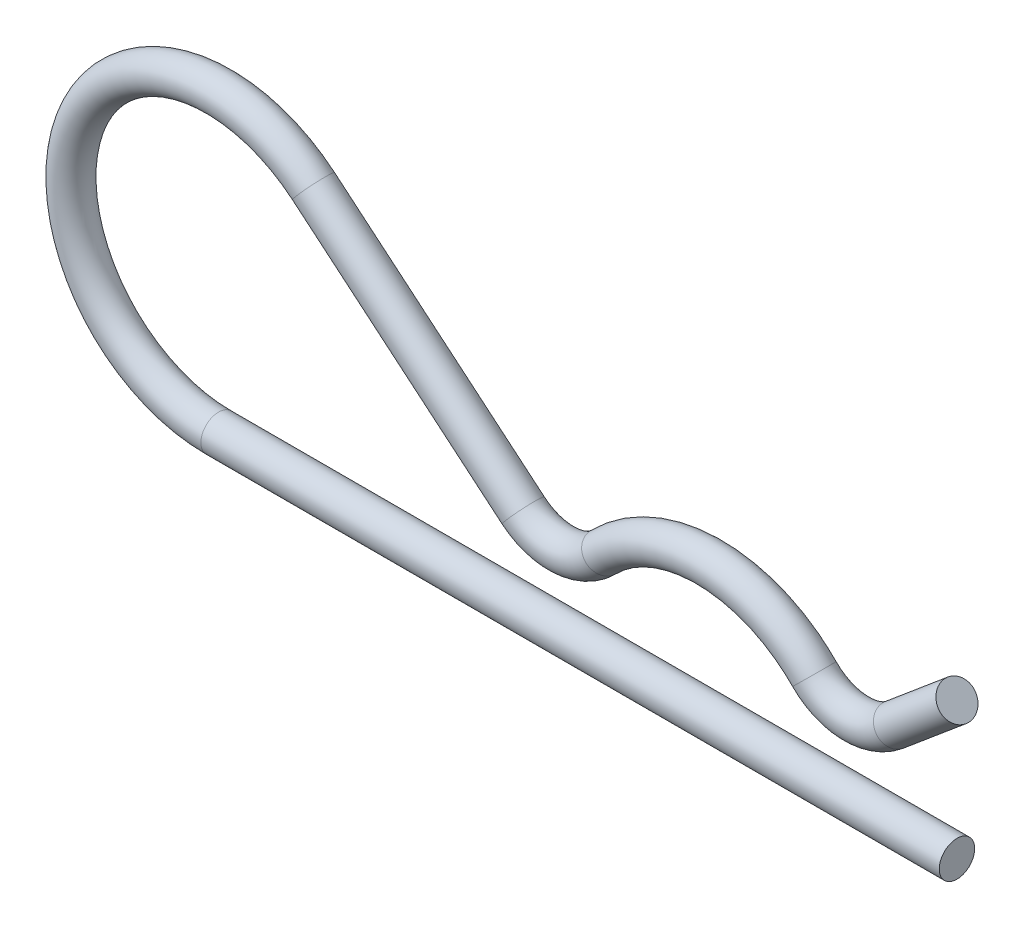
ISO-10303-21;
HEADER;
FILE_DESCRIPTION(('STEP AP214'),'2;1');
FILE_NAME('part.step','',(''),(''),'','','');
FILE_SCHEMA(('AUTOMOTIVE_DESIGN { 1 0 10303 214 1 1 1 1 }'));
ENDSEC;
DATA;
#1=APPLICATION_CONTEXT('core data for automotive mechanical design processes');
#2=APPLICATION_PROTOCOL_DEFINITION('international standard','automotive_design',2000,#1);
#3=PRODUCT_CONTEXT('',#1,'mechanical');
#4=PRODUCT('Part','Part','',(#3));
#5=PRODUCT_RELATED_PRODUCT_CATEGORY('part','',(#4));
#6=PRODUCT_DEFINITION_FORMATION('','',#4);
#7=PRODUCT_DEFINITION_CONTEXT('part definition',#1,'design');
#8=PRODUCT_DEFINITION('design','',#6,#7);
#9=PRODUCT_DEFINITION_SHAPE('','',#8);
#10=(LENGTH_UNIT() NAMED_UNIT(*) SI_UNIT(.MILLI.,.METRE.));
#11=(NAMED_UNIT(*) PLANE_ANGLE_UNIT() SI_UNIT($,.RADIAN.));
#12=(NAMED_UNIT(*) SI_UNIT($,.STERADIAN.) SOLID_ANGLE_UNIT());
#13=UNCERTAINTY_MEASURE_WITH_UNIT(LENGTH_MEASURE(1.E-05),#10,'distance_accuracy_value','');
#14=(GEOMETRIC_REPRESENTATION_CONTEXT(3) GLOBAL_UNCERTAINTY_ASSIGNED_CONTEXT((#13)) GLOBAL_UNIT_ASSIGNED_CONTEXT((#10,
#11,#12)) REPRESENTATION_CONTEXT('',''));
#15=CARTESIAN_POINT('',(0.,0.,0.));
#16=DIRECTION('',(0.,0.,1.));
#17=DIRECTION('',(1.,0.,0.));
#18=AXIS2_PLACEMENT_3D('',#15,#16,#17);
#19=CARTESIAN_POINT('',(0.,0.,0.));
#20=DIRECTION('',(1.,0.,0.));
#21=DIRECTION('',(0.,0.,-1.));
#22=AXIS2_PLACEMENT_3D('',#19,#20,#21);
#23=PLANE('',#22);
#24=CARTESIAN_POINT('',(0.,0.,0.));
#25=DIRECTION('',(1.,0.,0.));
#26=DIRECTION('',(0.,0.,-1.));
#27=AXIS2_PLACEMENT_3D('',#24,#25,#26);
#28=CIRCLE('',#27,1.524);
#29=CARTESIAN_POINT('',(0.,0.,-1.524));
#30=VERTEX_POINT('',#29);
#31=EDGE_CURVE('E72',#30,#30,#28,.T.);
#32=ORIENTED_EDGE('',*,*,#31,.T.);
#33=EDGE_LOOP('',(#32));
#34=FACE_BOUND('',#33,.T.);
#35=ADVANCED_FACE('F37',(#34),#23,.T.);
#36=CARTESIAN_POINT('',(0.,11.8019054563597,0.));
#37=DIRECTION('',(-0.766044443118981,-0.642787609686536,0.));
#38=DIRECTION('',(0.,0.,-1.));
#39=AXIS2_PLACEMENT_3D('',#36,#37,#38);
#40=PLANE('',#39);
#41=CARTESIAN_POINT('',(0.,11.8019054563597,0.));
#42=DIRECTION('',(-0.766044443118981,-0.642787609686536,0.));
#43=DIRECTION('',(0.,0.,-1.));
#44=AXIS2_PLACEMENT_3D('',#41,#42,#43);
#45=CIRCLE('',#44,1.524);
#46=CARTESIAN_POINT('',(0.,11.8019054563597,-1.524));
#47=VERTEX_POINT('',#46);
#48=EDGE_CURVE('E10',#47,#47,#45,.T.);
#49=ORIENTED_EDGE('',*,*,#48,.F.);
#50=EDGE_LOOP('',(#49));
#51=FACE_BOUND('',#50,.T.);
#52=ADVANCED_FACE('F81',(#51),#40,.F.);
#53=CARTESIAN_POINT('',(0.,0.,0.));
#54=DIRECTION('',(-1.,0.,0.));
#55=DIRECTION('',(0.,0.,1.));
#56=AXIS2_PLACEMENT_3D('',#53,#54,#55);
#57=CYLINDRICAL_SURFACE('',#56,1.524);
#58=CARTESIAN_POINT('',(-63.5,0.,0.));
#59=DIRECTION('',(1.,0.,0.));
#60=DIRECTION('',(0.,0.,-1.));
#61=AXIS2_PLACEMENT_3D('',#58,#59,#60);
#62=CIRCLE('',#61,1.524);
#63=CARTESIAN_POINT('',(-63.5,-1.524,0.));
#64=VERTEX_POINT('',#63);
#65=EDGE_CURVE('E68',#64,#64,#62,.T.);
#66=ORIENTED_EDGE('',*,*,#65,.T.);
#67=EDGE_LOOP('',(#66));
#68=FACE_BOUND('',#67,.T.);
#69=ORIENTED_EDGE('',*,*,#31,.F.);
#70=EDGE_LOOP('',(#69));
#71=FACE_BOUND('',#70,.T.);
#72=ADVANCED_FACE('F78',(#68,#71),#57,.T.);
#73=CARTESIAN_POINT('',(-63.5,12.7,0.));
#74=DIRECTION('',(0.,0.,-1.));
#75=DIRECTION('',(-1.,0.,0.));
#76=AXIS2_PLACEMENT_3D('',#73,#74,#75);
#77=TOROIDAL_SURFACE('',#76,12.7,1.524);
#78=CARTESIAN_POINT('',(-55.336597356981,22.4287644276111,0.));
#79=DIRECTION('',(-0.766044443118982,0.642787609686535,0.));
#80=DIRECTION('',(0.,0.,-1.));
#81=AXIS2_PLACEMENT_3D('',#78,#79,#80);
#82=CIRCLE('',#81,1.524);
#83=CARTESIAN_POINT('',(-54.3569890398187,23.5962161589244,0.));
#84=VERTEX_POINT('',#83);
#85=EDGE_CURVE('E64',#84,#84,#82,.T.);
#86=CARTESIAN_POINT('',(-63.5,12.7,0.));
#87=DIRECTION('',(0.,0.,-1.));
#88=DIRECTION('',(-1.,0.,0.));
#89=AXIS2_PLACEMENT_3D('',#86,#87,#88);
#90=CIRCLE('',#89,14.224);
#91=EDGE_CURVE('',#64,#84,#90,.T.);
#92=ORIENTED_EDGE('',*,*,#65,.F.);
#93=ORIENTED_EDGE('',*,*,#85,.T.);
#94=ORIENTED_EDGE('',*,*,#91,.T.);
#95=ORIENTED_EDGE('',*,*,#91,.F.);
#96=EDGE_LOOP('',(#92,#94,#93,#95));
#97=FACE_BOUND('',#96,.T.);
#98=ADVANCED_FACE('F80',(#97),#77,.T.);
#99=CARTESIAN_POINT('',(-55.336597356981,22.4287644276111,0.));
#100=DIRECTION('',(0.766044443118982,-0.642787609686535,0.));
#101=DIRECTION('',(0.642787609686535,0.766044443118982,0.));
#102=AXIS2_PLACEMENT_3D('',#99,#100,#101);
#103=CYLINDRICAL_SURFACE('',#102,1.524);
#104=CARTESIAN_POINT('',(-37.3013610572076,7.29540430027629,0.));
#105=DIRECTION('',(-0.766044443118982,0.642787609686535,0.));
#106=DIRECTION('',(0.,0.,-1.));
#107=AXIS2_PLACEMENT_3D('',#104,#105,#106);
#108=CIRCLE('',#107,1.524);
#109=CARTESIAN_POINT('',(-38.2809693743699,6.12795256896296,0.));
#110=VERTEX_POINT('',#109);
#111=EDGE_CURVE('E60',#110,#110,#108,.T.);
#112=ORIENTED_EDGE('',*,*,#111,.T.);
#113=EDGE_LOOP('',(#112));
#114=FACE_BOUND('',#113,.T.);
#115=ORIENTED_EDGE('',*,*,#85,.F.);
#116=EDGE_LOOP('',(#115));
#117=FACE_BOUND('',#116,.T.);
#118=ADVANCED_FACE('F88',(#114,#117),#103,.T.);
#119=CARTESIAN_POINT('',(-34.036,11.1869100713207,0.));
#120=DIRECTION('',(0.,0.,1.));
#121=DIRECTION('',(1.,0.,0.));
#122=AXIS2_PLACEMENT_3D('',#119,#120,#121);
#123=TOROIDAL_SURFACE('',#122,5.08,1.524);
#124=CARTESIAN_POINT('',(-30.4074285714286,7.63165067322398,0.));
#125=DIRECTION('',(-0.699854212223765,-0.714285714285714,0.));
#126=DIRECTION('',(0.,0.,-1.));
#127=AXIS2_PLACEMENT_3D('',#124,#125,#126);
#128=CIRCLE('',#127,1.524);
#129=CARTESIAN_POINT('',(-29.3188571428571,6.56507285379496,0.));
#130=VERTEX_POINT('',#129);
#131=EDGE_CURVE('E54',#130,#130,#128,.T.);
#132=CARTESIAN_POINT('',(-34.036,11.1869100713207,0.));
#133=DIRECTION('',(0.,0.,1.));
#134=DIRECTION('',(1.,0.,0.));
#135=AXIS2_PLACEMENT_3D('',#132,#133,#134);
#136=CIRCLE('',#135,6.604);
#137=EDGE_CURVE('',#110,#130,#136,.T.);
#138=ORIENTED_EDGE('',*,*,#111,.F.);
#139=ORIENTED_EDGE('',*,*,#131,.T.);
#140=ORIENTED_EDGE('',*,*,#137,.T.);
#141=ORIENTED_EDGE('',*,*,#137,.F.);
#142=EDGE_LOOP('',(#138,#140,#139,#141));
#143=FACE_BOUND('',#142,.T.);
#144=ADVANCED_FACE('F105',(#143),#123,.T.);
#145=CARTESIAN_POINT('',(-21.336,-1.25649782201783,0.));
#146=DIRECTION('',(0.,0.,-1.));
#147=DIRECTION('',(-1.,0.,0.));
#148=AXIS2_PLACEMENT_3D('',#145,#146,#147);
#149=TOROIDAL_SURFACE('',#148,12.7,1.524);
#150=CARTESIAN_POINT('',(-12.2645714285714,7.63165067322398,0.));
#151=DIRECTION('',(-0.699854212223765,0.714285714285714,0.));
#152=DIRECTION('',(0.,0.,-1.));
#153=AXIS2_PLACEMENT_3D('',#150,#151,#152);
#154=CIRCLE('',#153,1.524);
#155=CARTESIAN_POINT('',(-13.3531428571429,6.56507285379497,0.));
#156=VERTEX_POINT('',#155);
#157=EDGE_CURVE('E49',#156,#156,#154,.T.);
#158=ORIENTED_EDGE('',*,*,#157,.T.);
#159=EDGE_LOOP('',(#158));
#160=FACE_BOUND('',#159,.T.);
#161=ORIENTED_EDGE('',*,*,#131,.F.);
#162=EDGE_LOOP('',(#161));
#163=FACE_BOUND('',#162,.T.);
#164=ADVANCED_FACE('F99',(#160,#163),#149,.T.);
#165=CARTESIAN_POINT('',(-8.636,11.1869100713207,0.));
#166=DIRECTION('',(0.,0.,1.));
#167=DIRECTION('',(1.,0.,0.));
#168=AXIS2_PLACEMENT_3D('',#165,#166,#167);
#169=TOROIDAL_SURFACE('',#168,5.08,1.524);
#170=CARTESIAN_POINT('',(-5.37063894279241,7.29540430027629,0.));
#171=DIRECTION('',(-0.766044443118982,-0.642787609686534,0.));
#172=DIRECTION('',(0.,0.,-1.));
#173=AXIS2_PLACEMENT_3D('',#170,#171,#172);
#174=CIRCLE('',#173,1.524);
#175=CARTESIAN_POINT('',(-4.39103062563013,6.12795256896296,0.));
#176=VERTEX_POINT('',#175);
#177=EDGE_CURVE('E44',#176,#176,#174,.T.);
#178=CARTESIAN_POINT('',(-8.636,11.1869100713207,0.));
#179=DIRECTION('',(0.,0.,1.));
#180=DIRECTION('',(1.,0.,0.));
#181=AXIS2_PLACEMENT_3D('',#178,#179,#180);
#182=CIRCLE('',#181,6.604);
#183=EDGE_CURVE('',#156,#176,#182,.T.);
#184=ORIENTED_EDGE('',*,*,#157,.F.);
#185=ORIENTED_EDGE('',*,*,#177,.T.);
#186=ORIENTED_EDGE('',*,*,#183,.T.);
#187=ORIENTED_EDGE('',*,*,#183,.F.);
#188=EDGE_LOOP('',(#184,#186,#185,#187));
#189=FACE_BOUND('',#188,.T.);
#190=ADVANCED_FACE('F94',(#189),#169,.T.);
#191=CARTESIAN_POINT('',(-5.3706389427924,7.29540430027629,0.));
#192=DIRECTION('',(0.766044443118981,0.642787609686536,0.));
#193=DIRECTION('',(-0.642787609686536,0.766044443118981,0.));
#194=AXIS2_PLACEMENT_3D('',#191,#192,#193);
#195=CYLINDRICAL_SURFACE('',#194,1.524);
#196=ORIENTED_EDGE('',*,*,#48,.T.);
#197=EDGE_LOOP('',(#196));
#198=FACE_BOUND('',#197,.T.);
#199=ORIENTED_EDGE('',*,*,#177,.F.);
#200=EDGE_LOOP('',(#199));
#201=FACE_BOUND('',#200,.T.);
#202=ADVANCED_FACE('F92',(#198,#201),#195,.T.);
#203=CLOSED_SHELL('',(#35,#52,#72,#98,#118,#144,#164,#190,#202));
#204=MANIFOLD_SOLID_BREP('B2',#203);
#205=ADVANCED_BREP_SHAPE_REPRESENTATION('',(#18,#204),#14);
#206=SHAPE_DEFINITION_REPRESENTATION(#9,#205);
ENDSEC;
END-ISO-10303-21;
